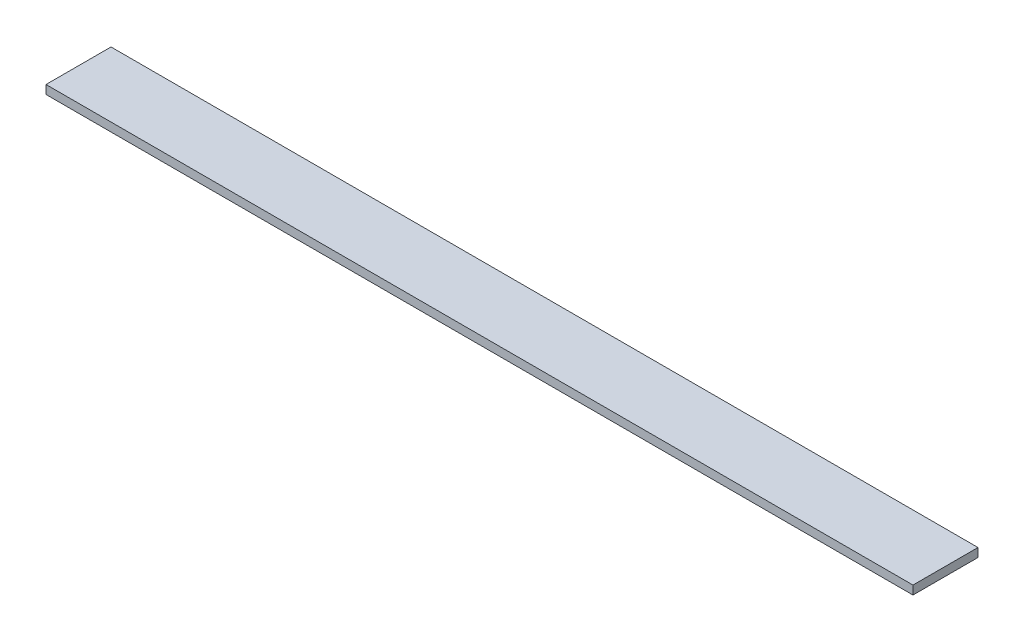
ISO-10303-21;
HEADER;
FILE_DESCRIPTION(('STEP AP214'),'2;1');
FILE_NAME('part.step','',(''),(''),'','','');
FILE_SCHEMA(('AUTOMOTIVE_DESIGN { 1 0 10303 214 1 1 1 1 }'));
ENDSEC;
DATA;
#1=APPLICATION_CONTEXT('core data for automotive mechanical design processes');
#2=APPLICATION_PROTOCOL_DEFINITION('international standard','automotive_design',2000,#1);
#3=PRODUCT_CONTEXT('',#1,'mechanical');
#4=PRODUCT('Part','Part','',(#3));
#5=PRODUCT_RELATED_PRODUCT_CATEGORY('part','',(#4));
#6=PRODUCT_DEFINITION_FORMATION('','',#4);
#7=PRODUCT_DEFINITION_CONTEXT('part definition',#1,'design');
#8=PRODUCT_DEFINITION('design','',#6,#7);
#9=PRODUCT_DEFINITION_SHAPE('','',#8);
#10=(LENGTH_UNIT() NAMED_UNIT(*) SI_UNIT(.MILLI.,.METRE.));
#11=(NAMED_UNIT(*) PLANE_ANGLE_UNIT() SI_UNIT($,.RADIAN.));
#12=(NAMED_UNIT(*) SI_UNIT($,.STERADIAN.) SOLID_ANGLE_UNIT());
#13=UNCERTAINTY_MEASURE_WITH_UNIT(LENGTH_MEASURE(1.E-05),#10,'distance_accuracy_value','');
#14=(GEOMETRIC_REPRESENTATION_CONTEXT(3) GLOBAL_UNCERTAINTY_ASSIGNED_CONTEXT((#13)) GLOBAL_UNIT_ASSIGNED_CONTEXT((#10,
#11,#12)) REPRESENTATION_CONTEXT('',''));
#15=CARTESIAN_POINT('',(0.,0.,0.));
#16=DIRECTION('',(0.,0.,1.));
#17=DIRECTION('',(1.,0.,0.));
#18=AXIS2_PLACEMENT_3D('',#15,#16,#17);
#19=CARTESIAN_POINT('',(400.,-2.,-15.));
#20=DIRECTION('',(0.,0.,1.));
#21=DIRECTION('',(1.,0.,0.));
#22=AXIS2_PLACEMENT_3D('',#19,#20,#21);
#23=PLANE('',#22);
#24=DIRECTION('',(0.,1.,0.));
#25=VECTOR('',#24,1.);
#26=CARTESIAN_POINT('',(0.,-2.,-15.));
#27=LINE('',#26,#25);
#28=CARTESIAN_POINT('',(0.,-2.,-15.));
#29=VERTEX_POINT('',#28);
#30=CARTESIAN_POINT('',(0.,2.,-15.));
#31=VERTEX_POINT('',#30);
#32=EDGE_CURVE('E97',#29,#31,#27,.T.);
#33=ORIENTED_EDGE('',*,*,#32,.T.);
#34=DIRECTION('',(-1.,0.,0.));
#35=VECTOR('',#34,1.);
#36=CARTESIAN_POINT('',(400.,2.,-15.));
#37=LINE('',#36,#35);
#38=CARTESIAN_POINT('',(400.,2.,-15.));
#39=VERTEX_POINT('',#38);
#40=EDGE_CURVE('E11',#39,#31,#37,.T.);
#41=ORIENTED_EDGE('',*,*,#40,.F.);
#42=DIRECTION('',(0.,1.,0.));
#43=VECTOR('',#42,1.);
#44=CARTESIAN_POINT('',(400.,-2.,-15.));
#45=LINE('',#44,#43);
#46=CARTESIAN_POINT('',(400.,-2.,-15.));
#47=VERTEX_POINT('',#46);
#48=EDGE_CURVE('E85',#47,#39,#45,.T.);
#49=ORIENTED_EDGE('',*,*,#48,.F.);
#50=DIRECTION('',(-1.,0.,0.));
#51=VECTOR('',#50,1.);
#52=CARTESIAN_POINT('',(400.,-2.,-15.));
#53=LINE('',#52,#51);
#54=EDGE_CURVE('E93',#47,#29,#53,.T.);
#55=ORIENTED_EDGE('',*,*,#54,.T.);
#56=EDGE_LOOP('',(#33,#41,#49,#55));
#57=FACE_BOUND('',#56,.T.);
#58=ADVANCED_FACE('F34',(#57),#23,.F.);
#59=CARTESIAN_POINT('',(400.,2.,15.));
#60=DIRECTION('',(0.,-1.,0.));
#61=DIRECTION('',(0.,0.,-1.));
#62=AXIS2_PLACEMENT_3D('',#59,#60,#61);
#63=PLANE('',#62);
#64=DIRECTION('',(0.,0.,1.));
#65=VECTOR('',#64,1.);
#66=CARTESIAN_POINT('',(0.,2.,15.));
#67=LINE('',#66,#65);
#68=CARTESIAN_POINT('',(0.,2.,15.));
#69=VERTEX_POINT('',#68);
#70=EDGE_CURVE('E89',#31,#69,#67,.T.);
#71=ORIENTED_EDGE('',*,*,#70,.T.);
#72=DIRECTION('',(-1.,0.,0.));
#73=VECTOR('',#72,1.);
#74=CARTESIAN_POINT('',(400.,2.,15.));
#75=LINE('',#74,#73);
#76=CARTESIAN_POINT('',(400.,2.,15.));
#77=VERTEX_POINT('',#76);
#78=EDGE_CURVE('E42',#77,#69,#75,.T.);
#79=ORIENTED_EDGE('',*,*,#78,.F.);
#80=DIRECTION('',(0.,0.,1.));
#81=VECTOR('',#80,1.);
#82=CARTESIAN_POINT('',(400.,2.,15.));
#83=LINE('',#82,#81);
#84=EDGE_CURVE('E80',#39,#77,#83,.T.);
#85=ORIENTED_EDGE('',*,*,#84,.F.);
#86=ORIENTED_EDGE('',*,*,#40,.T.);
#87=EDGE_LOOP('',(#71,#79,#85,#86));
#88=FACE_BOUND('',#87,.T.);
#89=ADVANCED_FACE('F88',(#88),#63,.F.);
#90=CARTESIAN_POINT('',(400.,-2.,15.));
#91=DIRECTION('',(0.,0.,-1.));
#92=DIRECTION('',(-1.,0.,0.));
#93=AXIS2_PLACEMENT_3D('',#90,#91,#92);
#94=PLANE('',#93);
#95=DIRECTION('',(0.,-1.,0.));
#96=VECTOR('',#95,1.);
#97=CARTESIAN_POINT('',(0.,-2.,15.));
#98=LINE('',#97,#96);
#99=CARTESIAN_POINT('',(0.,-2.,15.));
#100=VERTEX_POINT('',#99);
#101=EDGE_CURVE('E67',#69,#100,#98,.T.);
#102=ORIENTED_EDGE('',*,*,#101,.T.);
#103=DIRECTION('',(-1.,0.,0.));
#104=VECTOR('',#103,1.);
#105=CARTESIAN_POINT('',(400.,-2.,15.));
#106=LINE('',#105,#104);
#107=CARTESIAN_POINT('',(400.,-2.,15.));
#108=VERTEX_POINT('',#107);
#109=EDGE_CURVE('E90',#108,#100,#106,.T.);
#110=ORIENTED_EDGE('',*,*,#109,.F.);
#111=DIRECTION('',(0.,-1.,0.));
#112=VECTOR('',#111,1.);
#113=CARTESIAN_POINT('',(400.,-2.,15.));
#114=LINE('',#113,#112);
#115=EDGE_CURVE('E83',#77,#108,#114,.T.);
#116=ORIENTED_EDGE('',*,*,#115,.F.);
#117=ORIENTED_EDGE('',*,*,#78,.T.);
#118=EDGE_LOOP('',(#102,#110,#116,#117));
#119=FACE_BOUND('',#118,.T.);
#120=ADVANCED_FACE('F91',(#119),#94,.F.);
#121=CARTESIAN_POINT('',(400.,-2.,15.));
#122=DIRECTION('',(0.,1.,0.));
#123=DIRECTION('',(0.,0.,1.));
#124=AXIS2_PLACEMENT_3D('',#121,#122,#123);
#125=PLANE('',#124);
#126=DIRECTION('',(0.,0.,-1.));
#127=VECTOR('',#126,1.);
#128=CARTESIAN_POINT('',(0.,-2.,15.));
#129=LINE('',#128,#127);
#130=EDGE_CURVE('E73',#100,#29,#129,.T.);
#131=ORIENTED_EDGE('',*,*,#130,.T.);
#132=ORIENTED_EDGE('',*,*,#54,.F.);
#133=DIRECTION('',(0.,0.,-1.));
#134=VECTOR('',#133,1.);
#135=CARTESIAN_POINT('',(400.,-2.,15.));
#136=LINE('',#135,#134);
#137=EDGE_CURVE('E50',#108,#47,#136,.T.);
#138=ORIENTED_EDGE('',*,*,#137,.F.);
#139=ORIENTED_EDGE('',*,*,#109,.T.);
#140=EDGE_LOOP('',(#131,#132,#138,#139));
#141=FACE_BOUND('',#140,.T.);
#142=ADVANCED_FACE('F104',(#141),#125,.F.);
#143=CARTESIAN_POINT('',(400.,0.,0.));
#144=DIRECTION('',(-1.,0.,0.));
#145=DIRECTION('',(0.,0.,1.));
#146=AXIS2_PLACEMENT_3D('',#143,#144,#145);
#147=PLANE('',#146);
#148=ORIENTED_EDGE('',*,*,#48,.T.);
#149=ORIENTED_EDGE('',*,*,#84,.T.);
#150=ORIENTED_EDGE('',*,*,#115,.T.);
#151=ORIENTED_EDGE('',*,*,#137,.T.);
#152=EDGE_LOOP('',(#148,#149,#150,#151));
#153=FACE_BOUND('',#152,.T.);
#154=ADVANCED_FACE('F81',(#153),#147,.F.);
#155=CARTESIAN_POINT('',(0.,0.,0.));
#156=DIRECTION('',(-1.,0.,0.));
#157=DIRECTION('',(0.,0.,1.));
#158=AXIS2_PLACEMENT_3D('',#155,#156,#157);
#159=PLANE('',#158);
#160=ORIENTED_EDGE('',*,*,#32,.F.);
#161=ORIENTED_EDGE('',*,*,#130,.F.);
#162=ORIENTED_EDGE('',*,*,#101,.F.);
#163=ORIENTED_EDGE('',*,*,#70,.F.);
#164=EDGE_LOOP('',(#160,#161,#162,#163));
#165=FACE_BOUND('',#164,.T.);
#166=ADVANCED_FACE('F107',(#165),#159,.T.);
#167=CLOSED_SHELL('',(#58,#89,#120,#142,#154,#166));
#168=MANIFOLD_SOLID_BREP('B2',#167);
#169=ADVANCED_BREP_SHAPE_REPRESENTATION('',(#18,#168),#14);
#170=SHAPE_DEFINITION_REPRESENTATION(#9,#169);
ENDSEC;
END-ISO-10303-21;
